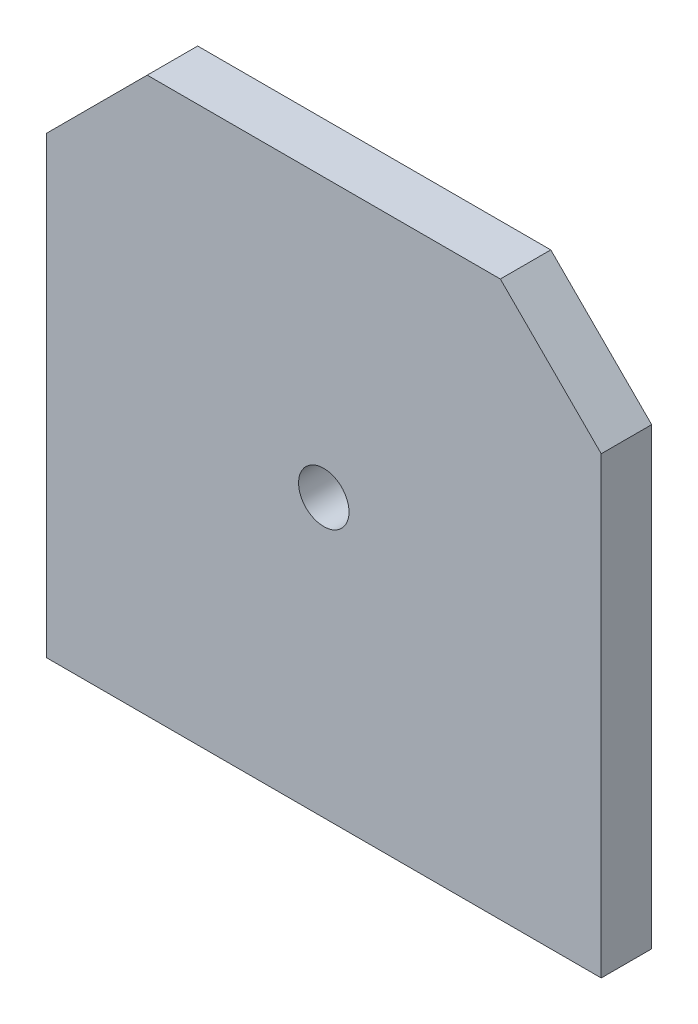
ISO-10303-21;
HEADER;
FILE_DESCRIPTION(('STEP AP214'),'2;1');
FILE_NAME('part.step','',(''),(''),'','','');
FILE_SCHEMA(('AUTOMOTIVE_DESIGN { 1 0 10303 214 1 1 1 1 }'));
ENDSEC;
DATA;
#1=APPLICATION_CONTEXT('core data for automotive mechanical design processes');
#2=APPLICATION_PROTOCOL_DEFINITION('international standard','automotive_design',2000,#1);
#3=PRODUCT_CONTEXT('',#1,'mechanical');
#4=PRODUCT('Part','Part','',(#3));
#5=PRODUCT_RELATED_PRODUCT_CATEGORY('part','',(#4));
#6=PRODUCT_DEFINITION_FORMATION('','',#4);
#7=PRODUCT_DEFINITION_CONTEXT('part definition',#1,'design');
#8=PRODUCT_DEFINITION('design','',#6,#7);
#9=PRODUCT_DEFINITION_SHAPE('','',#8);
#10=(LENGTH_UNIT() NAMED_UNIT(*) SI_UNIT(.MILLI.,.METRE.));
#11=(NAMED_UNIT(*) PLANE_ANGLE_UNIT() SI_UNIT($,.RADIAN.));
#12=(NAMED_UNIT(*) SI_UNIT($,.STERADIAN.) SOLID_ANGLE_UNIT());
#13=UNCERTAINTY_MEASURE_WITH_UNIT(LENGTH_MEASURE(1.E-05),#10,'distance_accuracy_value','');
#14=(GEOMETRIC_REPRESENTATION_CONTEXT(3) GLOBAL_UNCERTAINTY_ASSIGNED_CONTEXT((#13)) GLOBAL_UNIT_ASSIGNED_CONTEXT((#10,
#11,#12)) REPRESENTATION_CONTEXT('',''));
#15=CARTESIAN_POINT('',(0.,0.,0.));
#16=DIRECTION('',(0.,0.,1.));
#17=DIRECTION('',(1.,0.,0.));
#18=AXIS2_PLACEMENT_3D('',#15,#16,#17);
#19=CARTESIAN_POINT('',(0.,0.,5.));
#20=DIRECTION('',(0.,0.,1.));
#21=DIRECTION('',(1.,0.,0.));
#22=AXIS2_PLACEMENT_3D('',#19,#20,#21);
#23=PLANE('',#22);
#24=DIRECTION('',(0.,1.,0.));
#25=VECTOR('',#24,1.);
#26=CARTESIAN_POINT('',(27.5,17.5,5.));
#27=LINE('',#26,#25);
#28=CARTESIAN_POINT('',(27.5,-27.5,5.));
#29=VERTEX_POINT('',#28);
#30=CARTESIAN_POINT('',(27.5,17.5,5.));
#31=VERTEX_POINT('',#30);
#32=EDGE_CURVE('E129',#29,#31,#27,.T.);
#33=ORIENTED_EDGE('',*,*,#32,.T.);
#34=DIRECTION('',(-0.707106781186548,0.707106781186547,0.));
#35=VECTOR('',#34,1.);
#36=CARTESIAN_POINT('',(17.5,27.5,5.));
#37=LINE('',#36,#35);
#38=CARTESIAN_POINT('',(17.5,27.5,5.));
#39=VERTEX_POINT('',#38);
#40=EDGE_CURVE('E87',#31,#39,#37,.T.);
#41=ORIENTED_EDGE('',*,*,#40,.T.);
#42=DIRECTION('',(-1.,0.,0.));
#43=VECTOR('',#42,1.);
#44=CARTESIAN_POINT('',(-17.5,27.5,5.));
#45=LINE('',#44,#43);
#46=CARTESIAN_POINT('',(-17.5,27.5,5.));
#47=VERTEX_POINT('',#46);
#48=EDGE_CURVE('E100',#39,#47,#45,.T.);
#49=ORIENTED_EDGE('',*,*,#48,.T.);
#50=DIRECTION('',(-0.707106781186548,-0.707106781186547,0.));
#51=VECTOR('',#50,1.);
#52=CARTESIAN_POINT('',(-27.5,17.5,5.));
#53=LINE('',#52,#51);
#54=CARTESIAN_POINT('',(-27.5,17.5,5.));
#55=VERTEX_POINT('',#54);
#56=EDGE_CURVE('E94',#47,#55,#53,.T.);
#57=ORIENTED_EDGE('',*,*,#56,.T.);
#58=DIRECTION('',(0.,-1.,0.));
#59=VECTOR('',#58,1.);
#60=CARTESIAN_POINT('',(-27.5,17.5,5.));
#61=LINE('',#60,#59);
#62=CARTESIAN_POINT('',(-27.5,-27.5,5.));
#63=VERTEX_POINT('',#62);
#64=EDGE_CURVE('E98',#55,#63,#61,.T.);
#65=ORIENTED_EDGE('',*,*,#64,.T.);
#66=DIRECTION('',(1.,0.,0.));
#67=VECTOR('',#66,1.);
#68=CARTESIAN_POINT('',(-27.5,-27.5,5.));
#69=LINE('',#68,#67);
#70=EDGE_CURVE('E50',#63,#29,#69,.T.);
#71=ORIENTED_EDGE('',*,*,#70,.T.);
#72=EDGE_LOOP('',(#33,#41,#49,#57,#65,#71));
#73=FACE_BOUND('',#72,.T.);
#74=CARTESIAN_POINT('',(0.,0.,5.));
#75=DIRECTION('',(0.,0.,1.));
#76=DIRECTION('',(1.,0.,0.));
#77=AXIS2_PLACEMENT_3D('',#74,#75,#76);
#78=CIRCLE('',#77,2.5);
#79=CARTESIAN_POINT('',(2.5,0.,5.));
#80=VERTEX_POINT('',#79);
#81=EDGE_CURVE('E122',#80,#80,#78,.T.);
#82=ORIENTED_EDGE('',*,*,#81,.F.);
#83=EDGE_LOOP('',(#82));
#84=FACE_BOUND('',#83,.T.);
#85=ADVANCED_FACE('F33',(#73,#84),#23,.T.);
#86=CARTESIAN_POINT('',(0.,0.,0.));
#87=DIRECTION('',(0.,0.,1.));
#88=DIRECTION('',(1.,0.,0.));
#89=AXIS2_PLACEMENT_3D('',#86,#87,#88);
#90=PLANE('',#89);
#91=DIRECTION('',(0.,1.,0.));
#92=VECTOR('',#91,1.);
#93=CARTESIAN_POINT('',(27.5,17.5,0.));
#94=LINE('',#93,#92);
#95=CARTESIAN_POINT('',(27.5,-27.5,0.));
#96=VERTEX_POINT('',#95);
#97=CARTESIAN_POINT('',(27.5,17.5,0.));
#98=VERTEX_POINT('',#97);
#99=EDGE_CURVE('E118',#96,#98,#94,.T.);
#100=ORIENTED_EDGE('',*,*,#99,.F.);
#101=DIRECTION('',(1.,0.,0.));
#102=VECTOR('',#101,1.);
#103=CARTESIAN_POINT('',(-27.5,-27.5,0.));
#104=LINE('',#103,#102);
#105=CARTESIAN_POINT('',(-27.5,-27.5,0.));
#106=VERTEX_POINT('',#105);
#107=EDGE_CURVE('E79',#106,#96,#104,.T.);
#108=ORIENTED_EDGE('',*,*,#107,.F.);
#109=DIRECTION('',(0.,-1.,0.));
#110=VECTOR('',#109,1.);
#111=CARTESIAN_POINT('',(-27.5,17.5,0.));
#112=LINE('',#111,#110);
#113=CARTESIAN_POINT('',(-27.5,17.5,0.));
#114=VERTEX_POINT('',#113);
#115=EDGE_CURVE('E73',#114,#106,#112,.T.);
#116=ORIENTED_EDGE('',*,*,#115,.F.);
#117=DIRECTION('',(-0.707106781186548,-0.707106781186547,0.));
#118=VECTOR('',#117,1.);
#119=CARTESIAN_POINT('',(-27.5,17.5,0.));
#120=LINE('',#119,#118);
#121=CARTESIAN_POINT('',(-17.5,27.5,0.));
#122=VERTEX_POINT('',#121);
#123=EDGE_CURVE('E108',#122,#114,#120,.T.);
#124=ORIENTED_EDGE('',*,*,#123,.F.);
#125=DIRECTION('',(-1.,0.,0.));
#126=VECTOR('',#125,1.);
#127=CARTESIAN_POINT('',(-17.5,27.5,0.));
#128=LINE('',#127,#126);
#129=CARTESIAN_POINT('',(17.5,27.5,0.));
#130=VERTEX_POINT('',#129);
#131=EDGE_CURVE('E124',#130,#122,#128,.T.);
#132=ORIENTED_EDGE('',*,*,#131,.F.);
#133=DIRECTION('',(-0.707106781186548,0.707106781186547,0.));
#134=VECTOR('',#133,1.);
#135=CARTESIAN_POINT('',(17.5,27.5,0.));
#136=LINE('',#135,#134);
#137=EDGE_CURVE('E121',#98,#130,#136,.T.);
#138=ORIENTED_EDGE('',*,*,#137,.F.);
#139=EDGE_LOOP('',(#100,#108,#116,#124,#132,#138));
#140=FACE_BOUND('',#139,.T.);
#141=CARTESIAN_POINT('',(0.,0.,0.));
#142=DIRECTION('',(0.,0.,1.));
#143=DIRECTION('',(1.,0.,0.));
#144=AXIS2_PLACEMENT_3D('',#141,#142,#143);
#145=CIRCLE('',#144,2.5);
#146=CARTESIAN_POINT('',(2.5,0.,0.));
#147=VERTEX_POINT('',#146);
#148=EDGE_CURVE('E222',#147,#147,#145,.T.);
#149=ORIENTED_EDGE('',*,*,#148,.T.);
#150=EDGE_LOOP('',(#149));
#151=FACE_BOUND('',#150,.T.);
#152=ADVANCED_FACE('F138',(#140,#151),#90,.F.);
#153=CARTESIAN_POINT('',(27.5,17.5,5.));
#154=DIRECTION('',(-1.,0.,0.));
#155=DIRECTION('',(0.,-1.,0.));
#156=AXIS2_PLACEMENT_3D('',#153,#154,#155);
#157=PLANE('',#156);
#158=ORIENTED_EDGE('',*,*,#99,.T.);
#159=DIRECTION('',(0.,0.,-1.));
#160=VECTOR('',#159,1.);
#161=CARTESIAN_POINT('',(27.5,17.5,5.));
#162=LINE('',#161,#160);
#163=EDGE_CURVE('E11',#31,#98,#162,.T.);
#164=ORIENTED_EDGE('',*,*,#163,.F.);
#165=ORIENTED_EDGE('',*,*,#32,.F.);
#166=DIRECTION('',(0.,0.,-1.));
#167=VECTOR('',#166,1.);
#168=CARTESIAN_POINT('',(27.5,-27.5,5.));
#169=LINE('',#168,#167);
#170=EDGE_CURVE('E114',#29,#96,#169,.T.);
#171=ORIENTED_EDGE('',*,*,#170,.T.);
#172=EDGE_LOOP('',(#158,#164,#165,#171));
#173=FACE_BOUND('',#172,.T.);
#174=ADVANCED_FACE('F35',(#173),#157,.F.);
#175=CARTESIAN_POINT('',(17.5,27.5,5.));
#176=DIRECTION('',(-0.707106781186547,-0.707106781186548,0.));
#177=DIRECTION('',(0.707106781186548,-0.707106781186547,0.));
#178=AXIS2_PLACEMENT_3D('',#175,#176,#177);
#179=PLANE('',#178);
#180=ORIENTED_EDGE('',*,*,#137,.T.);
#181=DIRECTION('',(0.,0.,-1.));
#182=VECTOR('',#181,1.);
#183=CARTESIAN_POINT('',(17.5,27.5,5.));
#184=LINE('',#183,#182);
#185=EDGE_CURVE('E42',#39,#130,#184,.T.);
#186=ORIENTED_EDGE('',*,*,#185,.F.);
#187=ORIENTED_EDGE('',*,*,#40,.F.);
#188=ORIENTED_EDGE('',*,*,#163,.T.);
#189=EDGE_LOOP('',(#180,#186,#187,#188));
#190=FACE_BOUND('',#189,.T.);
#191=ADVANCED_FACE('F163',(#190),#179,.F.);
#192=CARTESIAN_POINT('',(-17.5,27.5,5.));
#193=DIRECTION('',(0.,-1.,0.));
#194=DIRECTION('',(0.,0.,-1.));
#195=AXIS2_PLACEMENT_3D('',#192,#193,#194);
#196=PLANE('',#195);
#197=ORIENTED_EDGE('',*,*,#131,.T.);
#198=DIRECTION('',(0.,0.,-1.));
#199=VECTOR('',#198,1.);
#200=CARTESIAN_POINT('',(-17.5,27.5,5.));
#201=LINE('',#200,#199);
#202=EDGE_CURVE('E109',#47,#122,#201,.T.);
#203=ORIENTED_EDGE('',*,*,#202,.F.);
#204=ORIENTED_EDGE('',*,*,#48,.F.);
#205=ORIENTED_EDGE('',*,*,#185,.T.);
#206=EDGE_LOOP('',(#197,#203,#204,#205));
#207=FACE_BOUND('',#206,.T.);
#208=ADVANCED_FACE('F135',(#207),#196,.F.);
#209=CARTESIAN_POINT('',(-27.5,17.5,5.));
#210=DIRECTION('',(0.707106781186547,-0.707106781186548,0.));
#211=DIRECTION('',(0.707106781186548,0.707106781186547,0.));
#212=AXIS2_PLACEMENT_3D('',#209,#210,#211);
#213=PLANE('',#212);
#214=ORIENTED_EDGE('',*,*,#123,.T.);
#215=DIRECTION('',(0.,0.,-1.));
#216=VECTOR('',#215,1.);
#217=CARTESIAN_POINT('',(-27.5,17.5,5.));
#218=LINE('',#217,#216);
#219=EDGE_CURVE('E105',#55,#114,#218,.T.);
#220=ORIENTED_EDGE('',*,*,#219,.F.);
#221=ORIENTED_EDGE('',*,*,#56,.F.);
#222=ORIENTED_EDGE('',*,*,#202,.T.);
#223=EDGE_LOOP('',(#214,#220,#221,#222));
#224=FACE_BOUND('',#223,.T.);
#225=ADVANCED_FACE('F106',(#224),#213,.F.);
#226=CARTESIAN_POINT('',(-27.5,17.5,5.));
#227=DIRECTION('',(1.,0.,0.));
#228=DIRECTION('',(0.,1.,0.));
#229=AXIS2_PLACEMENT_3D('',#226,#227,#228);
#230=PLANE('',#229);
#231=ORIENTED_EDGE('',*,*,#115,.T.);
#232=DIRECTION('',(0.,0.,-1.));
#233=VECTOR('',#232,1.);
#234=CARTESIAN_POINT('',(-27.5,-27.5,5.));
#235=LINE('',#234,#233);
#236=EDGE_CURVE('E110',#63,#106,#235,.T.);
#237=ORIENTED_EDGE('',*,*,#236,.F.);
#238=ORIENTED_EDGE('',*,*,#64,.F.);
#239=ORIENTED_EDGE('',*,*,#219,.T.);
#240=EDGE_LOOP('',(#231,#237,#238,#239));
#241=FACE_BOUND('',#240,.T.);
#242=ADVANCED_FACE('F112',(#241),#230,.F.);
#243=CARTESIAN_POINT('',(-27.5,-27.5,5.));
#244=DIRECTION('',(0.,1.,0.));
#245=DIRECTION('',(0.,0.,1.));
#246=AXIS2_PLACEMENT_3D('',#243,#244,#245);
#247=PLANE('',#246);
#248=ORIENTED_EDGE('',*,*,#107,.T.);
#249=ORIENTED_EDGE('',*,*,#170,.F.);
#250=ORIENTED_EDGE('',*,*,#70,.F.);
#251=ORIENTED_EDGE('',*,*,#236,.T.);
#252=EDGE_LOOP('',(#248,#249,#250,#251));
#253=FACE_BOUND('',#252,.T.);
#254=ADVANCED_FACE('F143',(#253),#247,.F.);
#255=CARTESIAN_POINT('',(0.,0.,5.));
#256=DIRECTION('',(0.,0.,-1.));
#257=DIRECTION('',(-1.,0.,0.));
#258=AXIS2_PLACEMENT_3D('',#255,#256,#257);
#259=CYLINDRICAL_SURFACE('',#258,2.5);
#260=ORIENTED_EDGE('',*,*,#81,.T.);
#261=EDGE_LOOP('',(#260));
#262=FACE_BOUND('',#261,.T.);
#263=ORIENTED_EDGE('',*,*,#148,.F.);
#264=EDGE_LOOP('',(#263));
#265=FACE_BOUND('',#264,.T.);
#266=ADVANCED_FACE('F145',(#262,#265),#259,.F.);
#267=CLOSED_SHELL('',(#85,#152,#174,#191,#208,#225,#242,#254,#266));
#268=MANIFOLD_SOLID_BREP('B2',#267);
#269=ADVANCED_BREP_SHAPE_REPRESENTATION('',(#18,#268),#14);
#270=SHAPE_DEFINITION_REPRESENTATION(#9,#269);
ENDSEC;
END-ISO-10303-21;
